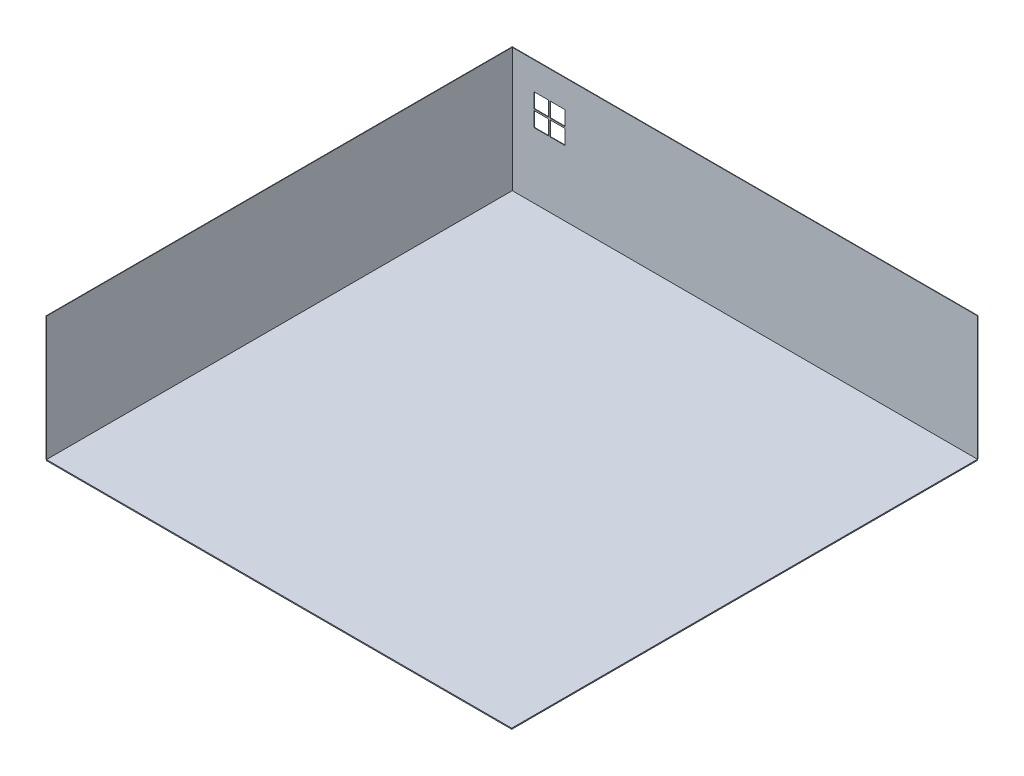
ISO-10303-21;
HEADER;
FILE_DESCRIPTION(('STEP AP214'),'2;1');
FILE_NAME('part.step','',(''),(''),'','','');
FILE_SCHEMA(('AUTOMOTIVE_DESIGN { 1 0 10303 214 1 1 1 1 }'));
ENDSEC;
DATA;
#1=APPLICATION_CONTEXT('core data for automotive mechanical design processes');
#2=APPLICATION_PROTOCOL_DEFINITION('international standard','automotive_design',2000,#1);
#3=PRODUCT_CONTEXT('',#1,'mechanical');
#4=PRODUCT('Part','Part','',(#3));
#5=PRODUCT_RELATED_PRODUCT_CATEGORY('part','',(#4));
#6=PRODUCT_DEFINITION_FORMATION('','',#4);
#7=PRODUCT_DEFINITION_CONTEXT('part definition',#1,'design');
#8=PRODUCT_DEFINITION('design','',#6,#7);
#9=PRODUCT_DEFINITION_SHAPE('','',#8);
#10=(LENGTH_UNIT() NAMED_UNIT(*) SI_UNIT(.MILLI.,.METRE.));
#11=(NAMED_UNIT(*) PLANE_ANGLE_UNIT() SI_UNIT($,.RADIAN.));
#12=(NAMED_UNIT(*) SI_UNIT($,.STERADIAN.) SOLID_ANGLE_UNIT());
#13=UNCERTAINTY_MEASURE_WITH_UNIT(LENGTH_MEASURE(1.E-05),#10,'distance_accuracy_value','');
#14=(GEOMETRIC_REPRESENTATION_CONTEXT(3) GLOBAL_UNCERTAINTY_ASSIGNED_CONTEXT((#13)) GLOBAL_UNIT_ASSIGNED_CONTEXT((#10,
#11,#12)) REPRESENTATION_CONTEXT('',''));
#15=CARTESIAN_POINT('',(0.,0.,0.));
#16=DIRECTION('',(0.,0.,1.));
#17=DIRECTION('',(1.,0.,0.));
#18=AXIS2_PLACEMENT_3D('',#15,#16,#17);
#19=CARTESIAN_POINT('',(9134.,-20.,0.));
#20=DIRECTION('',(1.,0.,0.));
#21=DIRECTION('',(0.,0.,-1.));
#22=AXIS2_PLACEMENT_3D('',#19,#20,#21);
#23=PLANE('',#22);
#24=DIRECTION('',(0.,0.,-1.));
#25=VECTOR('',#24,1.);
#26=CARTESIAN_POINT('',(9134.,0.,0.));
#27=LINE('',#26,#25);
#28=CARTESIAN_POINT('',(9134.,0.,3.72047697580966E-13));
#29=VERTEX_POINT('',#28);
#30=CARTESIAN_POINT('',(9134.,0.,-9144.));
#31=VERTEX_POINT('',#30);
#32=EDGE_CURVE('E121',#29,#31,#27,.T.);
#33=ORIENTED_EDGE('',*,*,#32,.F.);
#34=DIRECTION('',(0.,1.,0.));
#35=VECTOR('',#34,1.);
#36=CARTESIAN_POINT('',(9134.,-20.,3.72047697580966E-13));
#37=LINE('',#36,#35);
#38=CARTESIAN_POINT('',(9134.,-20.,3.72047697580966E-13));
#39=VERTEX_POINT('',#38);
#40=EDGE_CURVE('E12',#39,#29,#37,.T.);
#41=ORIENTED_EDGE('',*,*,#40,.F.);
#42=DIRECTION('',(0.,0.,-1.));
#43=VECTOR('',#42,1.);
#44=CARTESIAN_POINT('',(9134.,-20.,0.));
#45=LINE('',#44,#43);
#46=CARTESIAN_POINT('',(9134.,-20.,-9144.));
#47=VERTEX_POINT('',#46);
#48=EDGE_CURVE('E110',#39,#47,#45,.T.);
#49=ORIENTED_EDGE('',*,*,#48,.T.);
#50=DIRECTION('',(0.,1.,0.));
#51=VECTOR('',#50,1.);
#52=CARTESIAN_POINT('',(9134.,-20.,-9144.));
#53=LINE('',#52,#51);
#54=EDGE_CURVE('E70',#47,#31,#53,.T.);
#55=ORIENTED_EDGE('',*,*,#54,.T.);
#56=EDGE_LOOP('',(#33,#41,#49,#55));
#57=FACE_BOUND('',#56,.T.);
#58=ADVANCED_FACE('F53',(#57),#23,.T.);
#59=CARTESIAN_POINT('',(0.,-20.,0.));
#60=DIRECTION('',(0.,0.,1.));
#61=DIRECTION('',(1.,0.,0.));
#62=AXIS2_PLACEMENT_3D('',#59,#60,#61);
#63=PLANE('',#62);
#64=DIRECTION('',(1.,0.,0.));
#65=VECTOR('',#64,1.);
#66=CARTESIAN_POINT('',(0.,0.,0.));
#67=LINE('',#66,#65);
#68=CARTESIAN_POINT('',(0.,0.,0.));
#69=VERTEX_POINT('',#68);
#70=EDGE_CURVE('E100',#69,#29,#67,.T.);
#71=ORIENTED_EDGE('',*,*,#70,.F.);
#72=DIRECTION('',(0.,1.,0.));
#73=VECTOR('',#72,1.);
#74=CARTESIAN_POINT('',(0.,-20.,0.));
#75=LINE('',#74,#73);
#76=CARTESIAN_POINT('',(0.,-20.,0.));
#77=VERTEX_POINT('',#76);
#78=EDGE_CURVE('E62',#77,#69,#75,.T.);
#79=ORIENTED_EDGE('',*,*,#78,.F.);
#80=DIRECTION('',(1.,0.,0.));
#81=VECTOR('',#80,1.);
#82=CARTESIAN_POINT('',(0.,-20.,0.));
#83=LINE('',#82,#81);
#84=EDGE_CURVE('E98',#77,#39,#83,.T.);
#85=ORIENTED_EDGE('',*,*,#84,.T.);
#86=ORIENTED_EDGE('',*,*,#40,.T.);
#87=EDGE_LOOP('',(#71,#79,#85,#86));
#88=FACE_BOUND('',#87,.T.);
#89=ADVANCED_FACE('F97',(#88),#63,.T.);
#90=CARTESIAN_POINT('',(0.,-20.,0.));
#91=DIRECTION('',(-1.,0.,0.));
#92=DIRECTION('',(0.,0.,1.));
#93=AXIS2_PLACEMENT_3D('',#90,#91,#92);
#94=PLANE('',#93);
#95=DIRECTION('',(0.,0.,1.));
#96=VECTOR('',#95,1.);
#97=CARTESIAN_POINT('',(0.,0.,0.));
#98=LINE('',#97,#96);
#99=CARTESIAN_POINT('',(0.,0.,-9144.));
#100=VERTEX_POINT('',#99);
#101=EDGE_CURVE('E126',#100,#69,#98,.T.);
#102=ORIENTED_EDGE('',*,*,#101,.F.);
#103=DIRECTION('',(0.,1.,0.));
#104=VECTOR('',#103,1.);
#105=CARTESIAN_POINT('',(0.,-20.,-9144.));
#106=LINE('',#105,#104);
#107=CARTESIAN_POINT('',(0.,-20.,-9144.));
#108=VERTEX_POINT('',#107);
#109=EDGE_CURVE('E83',#108,#100,#106,.T.);
#110=ORIENTED_EDGE('',*,*,#109,.F.);
#111=DIRECTION('',(0.,0.,1.));
#112=VECTOR('',#111,1.);
#113=CARTESIAN_POINT('',(0.,-20.,0.));
#114=LINE('',#113,#112);
#115=EDGE_CURVE('E109',#108,#77,#114,.T.);
#116=ORIENTED_EDGE('',*,*,#115,.T.);
#117=ORIENTED_EDGE('',*,*,#78,.T.);
#118=EDGE_LOOP('',(#102,#110,#116,#117));
#119=FACE_BOUND('',#118,.T.);
#120=ADVANCED_FACE('F113',(#119),#94,.T.);
#121=CARTESIAN_POINT('',(0.,-20.,-9144.));
#122=DIRECTION('',(0.,0.,-1.));
#123=DIRECTION('',(-1.,0.,0.));
#124=AXIS2_PLACEMENT_3D('',#121,#122,#123);
#125=PLANE('',#124);
#126=DIRECTION('',(-1.,0.,0.));
#127=VECTOR('',#126,1.);
#128=CARTESIAN_POINT('',(0.,0.,-9144.));
#129=LINE('',#128,#127);
#130=EDGE_CURVE('E129',#31,#100,#129,.T.);
#131=ORIENTED_EDGE('',*,*,#130,.F.);
#132=ORIENTED_EDGE('',*,*,#54,.F.);
#133=DIRECTION('',(-1.,0.,0.));
#134=VECTOR('',#133,1.);
#135=CARTESIAN_POINT('',(0.,-20.,-9144.));
#136=LINE('',#135,#134);
#137=EDGE_CURVE('E115',#47,#108,#136,.T.);
#138=ORIENTED_EDGE('',*,*,#137,.T.);
#139=ORIENTED_EDGE('',*,*,#109,.T.);
#140=EDGE_LOOP('',(#131,#132,#138,#139));
#141=FACE_BOUND('',#140,.T.);
#142=ADVANCED_FACE('F138',(#141),#125,.T.);
#143=CARTESIAN_POINT('',(0.,-20.,0.));
#144=DIRECTION('',(0.,-1.,0.));
#145=DIRECTION('',(0.,0.,-1.));
#146=AXIS2_PLACEMENT_3D('',#143,#144,#145);
#147=PLANE('',#146);
#148=ORIENTED_EDGE('',*,*,#48,.F.);
#149=ORIENTED_EDGE('',*,*,#84,.F.);
#150=ORIENTED_EDGE('',*,*,#115,.F.);
#151=ORIENTED_EDGE('',*,*,#137,.F.);
#152=EDGE_LOOP('',(#148,#149,#150,#151));
#153=FACE_BOUND('',#152,.T.);
#154=ADVANCED_FACE('F107',(#153),#147,.T.);
#155=CARTESIAN_POINT('',(0.,0.,0.));
#156=DIRECTION('',(0.,-1.,0.));
#157=DIRECTION('',(0.,0.,-1.));
#158=AXIS2_PLACEMENT_3D('',#155,#156,#157);
#159=PLANE('',#158);
#160=ORIENTED_EDGE('',*,*,#32,.T.);
#161=ORIENTED_EDGE('',*,*,#130,.T.);
#162=ORIENTED_EDGE('',*,*,#101,.T.);
#163=ORIENTED_EDGE('',*,*,#70,.T.);
#164=EDGE_LOOP('',(#160,#161,#162,#163));
#165=FACE_BOUND('',#164,.T.);
#166=ADVANCED_FACE('F145',(#165),#159,.F.);
#167=CLOSED_SHELL('',(#58,#89,#120,#142,#154,#166));
#168=MANIFOLD_SOLID_BREP('B2',#167);
#169=CARTESIAN_POINT('',(-10.,2438.4,-9154.));
#170=DIRECTION('',(0.,0.,-1.));
#171=DIRECTION('',(-1.,0.,0.));
#172=AXIS2_PLACEMENT_3D('',#169,#170,#171);
#173=PLANE('',#172);
#174=DIRECTION('',(1.,0.,0.));
#175=VECTOR('',#174,1.);
#176=CARTESIAN_POINT('',(0.,1605.40968708855,-9154.));
#177=LINE('',#176,#175);
#178=CARTESIAN_POINT('',(422.962791313637,1605.40968708855,-9154.));
#179=VERTEX_POINT('',#178);
#180=CARTESIAN_POINT('',(712.762791313637,1605.40968708855,-9154.));
#181=VERTEX_POINT('',#180);
#182=EDGE_CURVE('E446',#179,#181,#177,.T.);
#183=ORIENTED_EDGE('',*,*,#182,.T.);
#184=DIRECTION('',(0.,1.,0.));
#185=VECTOR('',#184,1.);
#186=CARTESIAN_POINT('',(712.762791313637,0.,-9154.));
#187=LINE('',#186,#185);
#188=CARTESIAN_POINT('',(712.762791313637,1895.20968708855,-9154.));
#189=VERTEX_POINT('',#188);
#190=EDGE_CURVE('E449',#181,#189,#187,.T.);
#191=ORIENTED_EDGE('',*,*,#190,.T.);
#192=DIRECTION('',(1.,0.,0.));
#193=VECTOR('',#192,1.);
#194=CARTESIAN_POINT('',(6.90323304166125E-13,1895.20968708855,-9154.));
#195=LINE('',#194,#193);
#196=CARTESIAN_POINT('',(422.962791313637,1895.20968708855,-9154.));
#197=VERTEX_POINT('',#196);
#198=EDGE_CURVE('E453',#197,#189,#195,.T.);
#199=ORIENTED_EDGE('',*,*,#198,.F.);
#200=DIRECTION('',(0.,1.,0.));
#201=VECTOR('',#200,1.);
#202=CARTESIAN_POINT('',(422.962791313637,0.,-9154.));
#203=LINE('',#202,#201);
#204=EDGE_CURVE('E456',#179,#197,#203,.T.);
#205=ORIENTED_EDGE('',*,*,#204,.F.);
#206=EDGE_LOOP('',(#183,#191,#199,#205));
#207=FACE_BOUND('',#206,.T.);
#208=DIRECTION('',(1.,0.,0.));
#209=VECTOR('',#208,1.);
#210=CARTESIAN_POINT('',(-10.,0.,-9154.));
#211=LINE('',#210,#209);
#212=CARTESIAN_POINT('',(-10.,0.,-9154.));
#213=VERTEX_POINT('',#212);
#214=CARTESIAN_POINT('',(9134.,0.,-9154.));
#215=VERTEX_POINT('',#214);
#216=EDGE_CURVE('E499',#213,#215,#211,.T.);
#217=ORIENTED_EDGE('',*,*,#216,.F.);
#218=DIRECTION('',(0.,-1.,0.));
#219=VECTOR('',#218,1.);
#220=CARTESIAN_POINT('',(-10.,2438.4,-9154.));
#221=LINE('',#220,#219);
#222=CARTESIAN_POINT('',(-10.,2438.4,-9154.));
#223=VERTEX_POINT('',#222);
#224=EDGE_CURVE('E504',#223,#213,#221,.T.);
#225=ORIENTED_EDGE('',*,*,#224,.F.);
#226=DIRECTION('',(1.,0.,0.));
#227=VECTOR('',#226,1.);
#228=CARTESIAN_POINT('',(-10.,2438.4,-9154.));
#229=LINE('',#228,#227);
#230=CARTESIAN_POINT('',(9134.,2438.4,-9154.));
#231=VERTEX_POINT('',#230);
#232=EDGE_CURVE('E501',#223,#231,#229,.T.);
#233=ORIENTED_EDGE('',*,*,#232,.T.);
#234=DIRECTION('',(0.,-1.,0.));
#235=VECTOR('',#234,1.);
#236=CARTESIAN_POINT('',(9134.,2438.4,-9154.));
#237=LINE('',#236,#235);
#238=EDGE_CURVE('E512',#231,#215,#237,.T.);
#239=ORIENTED_EDGE('',*,*,#238,.T.);
#240=EDGE_LOOP('',(#217,#225,#233,#239));
#241=FACE_BOUND('',#240,.T.);
#242=DIRECTION('',(1.,0.,0.));
#243=VECTOR('',#242,1.);
#244=CARTESIAN_POINT('',(6.90323304166125E-13,1895.20968708855,-9154.));
#245=LINE('',#244,#243);
#246=CARTESIAN_POINT('',(742.762791313637,1895.20968708855,-9154.));
#247=VERTEX_POINT('',#246);
#248=CARTESIAN_POINT('',(1032.56279131364,1895.20968708855,-9154.));
#249=VERTEX_POINT('',#248);
#250=EDGE_CURVE('E356',#247,#249,#245,.T.);
#251=ORIENTED_EDGE('',*,*,#250,.F.);
#252=DIRECTION('',(0.,1.,0.));
#253=VECTOR('',#252,1.);
#254=CARTESIAN_POINT('',(742.762791313637,0.,-9154.));
#255=LINE('',#254,#253);
#256=CARTESIAN_POINT('',(742.762791313637,1605.40968708855,-9154.));
#257=VERTEX_POINT('',#256);
#258=EDGE_CURVE('E348',#257,#247,#255,.T.);
#259=ORIENTED_EDGE('',*,*,#258,.F.);
#260=DIRECTION('',(1.,0.,0.));
#261=VECTOR('',#260,1.);
#262=CARTESIAN_POINT('',(0.,1605.40968708855,-9154.));
#263=LINE('',#262,#261);
#264=CARTESIAN_POINT('',(1032.56279131364,1605.40968708855,-9154.));
#265=VERTEX_POINT('',#264);
#266=EDGE_CURVE('E360',#257,#265,#263,.T.);
#267=ORIENTED_EDGE('',*,*,#266,.T.);
#268=DIRECTION('',(0.,1.,0.));
#269=VECTOR('',#268,1.);
#270=CARTESIAN_POINT('',(1032.56279131364,0.,-9154.));
#271=LINE('',#270,#269);
#272=EDGE_CURVE('E364',#265,#249,#271,.T.);
#273=ORIENTED_EDGE('',*,*,#272,.T.);
#274=EDGE_LOOP('',(#251,#259,#267,#273));
#275=FACE_BOUND('',#274,.T.);
#276=DIRECTION('',(0.,1.,0.));
#277=VECTOR('',#276,1.);
#278=CARTESIAN_POINT('',(1032.56279131364,0.,-9154.));
#279=LINE('',#278,#277);
#280=CARTESIAN_POINT('',(1032.56279131364,1285.60968708855,-9154.));
#281=VERTEX_POINT('',#280);
#282=CARTESIAN_POINT('',(1032.56279131364,1575.40968708855,-9154.));
#283=VERTEX_POINT('',#282);
#284=EDGE_CURVE('E395',#281,#283,#279,.T.);
#285=ORIENTED_EDGE('',*,*,#284,.T.);
#286=DIRECTION('',(1.,0.,0.));
#287=VECTOR('',#286,1.);
#288=CARTESIAN_POINT('',(0.,1575.40968708855,-9154.));
#289=LINE('',#288,#287);
#290=CARTESIAN_POINT('',(742.762791313637,1575.40968708855,-9154.));
#291=VERTEX_POINT('',#290);
#292=EDGE_CURVE('E388',#291,#283,#289,.T.);
#293=ORIENTED_EDGE('',*,*,#292,.F.);
#294=DIRECTION('',(0.,-1.,0.));
#295=VECTOR('',#294,1.);
#296=CARTESIAN_POINT('',(742.762791313637,0.,-9154.));
#297=LINE('',#296,#295);
#298=CARTESIAN_POINT('',(742.762791313637,1285.60968708855,-9154.));
#299=VERTEX_POINT('',#298);
#300=EDGE_CURVE('E390',#291,#299,#297,.T.);
#301=ORIENTED_EDGE('',*,*,#300,.T.);
#302=DIRECTION('',(1.,0.,0.));
#303=VECTOR('',#302,1.);
#304=CARTESIAN_POINT('',(4.68278699241094E-13,1285.60968708855,-9154.));
#305=LINE('',#304,#303);
#306=EDGE_CURVE('E219',#299,#281,#305,.T.);
#307=ORIENTED_EDGE('',*,*,#306,.T.);
#308=EDGE_LOOP('',(#285,#293,#301,#307));
#309=FACE_BOUND('',#308,.T.);
#310=DIRECTION('',(1.,0.,0.));
#311=VECTOR('',#310,1.);
#312=CARTESIAN_POINT('',(4.68278699241094E-13,1285.60968708855,-9154.));
#313=LINE('',#312,#311);
#314=CARTESIAN_POINT('',(422.962791313637,1285.60968708855,-9154.));
#315=VERTEX_POINT('',#314);
#316=CARTESIAN_POINT('',(712.762791313637,1285.60968708855,-9154.));
#317=VERTEX_POINT('',#316);
#318=EDGE_CURVE('E425',#315,#317,#313,.T.);
#319=ORIENTED_EDGE('',*,*,#318,.T.);
#320=DIRECTION('',(0.,-1.,0.));
#321=VECTOR('',#320,1.);
#322=CARTESIAN_POINT('',(712.762791313637,0.,-9154.));
#323=LINE('',#322,#321);
#324=CARTESIAN_POINT('',(712.762791313637,1575.40968708855,-9154.));
#325=VERTEX_POINT('',#324);
#326=EDGE_CURVE('E418',#325,#317,#323,.T.);
#327=ORIENTED_EDGE('',*,*,#326,.F.);
#328=DIRECTION('',(1.,0.,0.));
#329=VECTOR('',#328,1.);
#330=CARTESIAN_POINT('',(0.,1575.40968708855,-9154.));
#331=LINE('',#330,#329);
#332=CARTESIAN_POINT('',(422.962791313637,1575.40968708855,-9154.));
#333=VERTEX_POINT('',#332);
#334=EDGE_CURVE('E420',#333,#325,#331,.T.);
#335=ORIENTED_EDGE('',*,*,#334,.F.);
#336=DIRECTION('',(0.,1.,0.));
#337=VECTOR('',#336,1.);
#338=CARTESIAN_POINT('',(422.962791313637,0.,-9154.));
#339=LINE('',#338,#337);
#340=EDGE_CURVE('E423',#315,#333,#339,.T.);
#341=ORIENTED_EDGE('',*,*,#340,.F.);
#342=EDGE_LOOP('',(#319,#327,#335,#341));
#343=FACE_BOUND('',#342,.T.);
#344=ADVANCED_FACE('F194',(#207,#241,#275,#309,#343),#173,.T.);
#345=CARTESIAN_POINT('',(-10.,2438.4,-9144.));
#346=DIRECTION('',(0.,0.,-1.));
#347=DIRECTION('',(-1.,0.,0.));
#348=AXIS2_PLACEMENT_3D('',#345,#346,#347);
#349=PLANE('',#348);
#350=DIRECTION('',(1.,0.,0.));
#351=VECTOR('',#350,1.);
#352=CARTESIAN_POINT('',(0.,1575.40968708855,-9144.));
#353=LINE('',#352,#351);
#354=CARTESIAN_POINT('',(742.762791313637,1575.40968708855,-9144.));
#355=VERTEX_POINT('',#354);
#356=CARTESIAN_POINT('',(1032.56279131364,1575.40968708855,-9144.));
#357=VERTEX_POINT('',#356);
#358=EDGE_CURVE('E399',#355,#357,#353,.T.);
#359=ORIENTED_EDGE('',*,*,#358,.T.);
#360=DIRECTION('',(0.,1.,0.));
#361=VECTOR('',#360,1.);
#362=CARTESIAN_POINT('',(1032.56279131364,0.,-9144.));
#363=LINE('',#362,#361);
#364=CARTESIAN_POINT('',(1032.56279131364,1285.60968708855,-9144.));
#365=VERTEX_POINT('',#364);
#366=EDGE_CURVE('E391',#365,#357,#363,.T.);
#367=ORIENTED_EDGE('',*,*,#366,.F.);
#368=DIRECTION('',(1.,0.,0.));
#369=VECTOR('',#368,1.);
#370=CARTESIAN_POINT('',(4.68278699241094E-13,1285.60968708855,-9144.));
#371=LINE('',#370,#369);
#372=CARTESIAN_POINT('',(742.762791313637,1285.60968708855,-9144.));
#373=VERTEX_POINT('',#372);
#374=EDGE_CURVE('E406',#373,#365,#371,.T.);
#375=ORIENTED_EDGE('',*,*,#374,.F.);
#376=DIRECTION('',(0.,-1.,0.));
#377=VECTOR('',#376,1.);
#378=CARTESIAN_POINT('',(742.762791313637,0.,-9144.));
#379=LINE('',#378,#377);
#380=EDGE_CURVE('E402',#355,#373,#379,.T.);
#381=ORIENTED_EDGE('',*,*,#380,.F.);
#382=EDGE_LOOP('',(#359,#367,#375,#381));
#383=FACE_BOUND('',#382,.T.);
#384=DIRECTION('',(1.,0.,0.));
#385=VECTOR('',#384,1.);
#386=CARTESIAN_POINT('',(-10.,2438.4,-9144.));
#387=LINE('',#386,#385);
#388=CARTESIAN_POINT('',(0.,2438.4,-9144.));
#389=VERTEX_POINT('',#388);
#390=CARTESIAN_POINT('',(9134.,2438.4,-9144.));
#391=VERTEX_POINT('',#390);
#392=EDGE_CURVE('E496',#389,#391,#387,.T.);
#393=ORIENTED_EDGE('',*,*,#392,.F.);
#394=DIRECTION('',(0.,-1.,0.));
#395=VECTOR('',#394,1.);
#396=CARTESIAN_POINT('',(0.,2438.4,-9144.));
#397=LINE('',#396,#395);
#398=CARTESIAN_POINT('',(0.,0.,-9144.));
#399=VERTEX_POINT('',#398);
#400=EDGE_CURVE('E486',#389,#399,#397,.T.);
#401=ORIENTED_EDGE('',*,*,#400,.T.);
#402=DIRECTION('',(1.,0.,0.));
#403=VECTOR('',#402,1.);
#404=CARTESIAN_POINT('',(-10.,0.,-9144.));
#405=LINE('',#404,#403);
#406=CARTESIAN_POINT('',(9134.,0.,-9144.));
#407=VERTEX_POINT('',#406);
#408=EDGE_CURVE('E470',#399,#407,#405,.T.);
#409=ORIENTED_EDGE('',*,*,#408,.T.);
#410=DIRECTION('',(0.,-1.,0.));
#411=VECTOR('',#410,1.);
#412=CARTESIAN_POINT('',(9134.,2438.4,-9144.));
#413=LINE('',#412,#411);
#414=EDGE_CURVE('E198',#391,#407,#413,.T.);
#415=ORIENTED_EDGE('',*,*,#414,.F.);
#416=EDGE_LOOP('',(#393,#401,#409,#415));
#417=FACE_BOUND('',#416,.T.);
#418=DIRECTION('',(0.,1.,0.));
#419=VECTOR('',#418,1.);
#420=CARTESIAN_POINT('',(712.762791313637,0.,-9144.));
#421=LINE('',#420,#419);
#422=CARTESIAN_POINT('',(712.762791313637,1605.40968708855,-9144.));
#423=VERTEX_POINT('',#422);
#424=CARTESIAN_POINT('',(712.762791313637,1895.20968708855,-9144.));
#425=VERTEX_POINT('',#424);
#426=EDGE_CURVE('E460',#423,#425,#421,.T.);
#427=ORIENTED_EDGE('',*,*,#426,.F.);
#428=DIRECTION('',(1.,0.,0.));
#429=VECTOR('',#428,1.);
#430=CARTESIAN_POINT('',(0.,1605.40968708855,-9144.));
#431=LINE('',#430,#429);
#432=CARTESIAN_POINT('',(422.962791313637,1605.40968708855,-9144.));
#433=VERTEX_POINT('',#432);
#434=EDGE_CURVE('E384',#433,#423,#431,.T.);
#435=ORIENTED_EDGE('',*,*,#434,.F.);
#436=DIRECTION('',(0.,1.,0.));
#437=VECTOR('',#436,1.);
#438=CARTESIAN_POINT('',(422.962791313637,0.,-9144.));
#439=LINE('',#438,#437);
#440=CARTESIAN_POINT('',(422.962791313637,1895.20968708855,-9144.));
#441=VERTEX_POINT('',#440);
#442=EDGE_CURVE('E450',#433,#441,#439,.T.);
#443=ORIENTED_EDGE('',*,*,#442,.T.);
#444=DIRECTION('',(1.,0.,0.));
#445=VECTOR('',#444,1.);
#446=CARTESIAN_POINT('',(6.90323304166125E-13,1895.20968708855,-9144.));
#447=LINE('',#446,#445);
#448=EDGE_CURVE('E463',#441,#425,#447,.T.);
#449=ORIENTED_EDGE('',*,*,#448,.T.);
#450=EDGE_LOOP('',(#427,#435,#443,#449));
#451=FACE_BOUND('',#450,.T.);
#452=DIRECTION('',(0.,1.,0.));
#453=VECTOR('',#452,1.);
#454=CARTESIAN_POINT('',(742.762791313637,0.,-9144.));
#455=LINE('',#454,#453);
#456=CARTESIAN_POINT('',(742.762791313637,1605.40968708855,-9144.));
#457=VERTEX_POINT('',#456);
#458=CARTESIAN_POINT('',(742.762791313637,1895.20968708855,-9144.));
#459=VERTEX_POINT('',#458);
#460=EDGE_CURVE('E351',#457,#459,#455,.T.);
#461=ORIENTED_EDGE('',*,*,#460,.T.);
#462=DIRECTION('',(1.,0.,0.));
#463=VECTOR('',#462,1.);
#464=CARTESIAN_POINT('',(6.90323304166125E-13,1895.20968708855,-9144.));
#465=LINE('',#464,#463);
#466=CARTESIAN_POINT('',(1032.56279131364,1895.20968708855,-9144.));
#467=VERTEX_POINT('',#466);
#468=EDGE_CURVE('E368',#459,#467,#465,.T.);
#469=ORIENTED_EDGE('',*,*,#468,.T.);
#470=DIRECTION('',(0.,1.,0.));
#471=VECTOR('',#470,1.);
#472=CARTESIAN_POINT('',(1032.56279131364,0.,-9144.));
#473=LINE('',#472,#471);
#474=CARTESIAN_POINT('',(1032.56279131364,1605.40968708855,-9144.));
#475=VERTEX_POINT('',#474);
#476=EDGE_CURVE('E371',#475,#467,#473,.T.);
#477=ORIENTED_EDGE('',*,*,#476,.F.);
#478=DIRECTION('',(1.,0.,0.));
#479=VECTOR('',#478,1.);
#480=CARTESIAN_POINT('',(0.,1605.40968708855,-9144.));
#481=LINE('',#480,#479);
#482=EDGE_CURVE('E377',#457,#475,#481,.T.);
#483=ORIENTED_EDGE('',*,*,#482,.F.);
#484=EDGE_LOOP('',(#461,#469,#477,#483));
#485=FACE_BOUND('',#484,.T.);
#486=DIRECTION('',(0.,-1.,0.));
#487=VECTOR('',#486,1.);
#488=CARTESIAN_POINT('',(712.762791313637,0.,-9144.));
#489=LINE('',#488,#487);
#490=CARTESIAN_POINT('',(712.762791313637,1575.40968708855,-9144.));
#491=VERTEX_POINT('',#490);
#492=CARTESIAN_POINT('',(712.762791313637,1285.60968708855,-9144.));
#493=VERTEX_POINT('',#492);
#494=EDGE_CURVE('E429',#491,#493,#489,.T.);
#495=ORIENTED_EDGE('',*,*,#494,.T.);
#496=DIRECTION('',(1.,0.,0.));
#497=VECTOR('',#496,1.);
#498=CARTESIAN_POINT('',(4.68278699241094E-13,1285.60968708855,-9144.));
#499=LINE('',#498,#497);
#500=CARTESIAN_POINT('',(422.962791313637,1285.60968708855,-9144.));
#501=VERTEX_POINT('',#500);
#502=EDGE_CURVE('E421',#501,#493,#499,.T.);
#503=ORIENTED_EDGE('',*,*,#502,.F.);
#504=DIRECTION('',(0.,1.,0.));
#505=VECTOR('',#504,1.);
#506=CARTESIAN_POINT('',(422.962791313637,0.,-9144.));
#507=LINE('',#506,#505);
#508=CARTESIAN_POINT('',(422.962791313637,1575.40968708855,-9144.));
#509=VERTEX_POINT('',#508);
#510=EDGE_CURVE('E435',#501,#509,#507,.T.);
#511=ORIENTED_EDGE('',*,*,#510,.T.);
#512=DIRECTION('',(1.,0.,0.));
#513=VECTOR('',#512,1.);
#514=CARTESIAN_POINT('',(0.,1575.40968708855,-9144.));
#515=LINE('',#514,#513);
#516=EDGE_CURVE('E432',#509,#491,#515,.T.);
#517=ORIENTED_EDGE('',*,*,#516,.T.);
#518=EDGE_LOOP('',(#495,#503,#511,#517));
#519=FACE_BOUND('',#518,.T.);
#520=ADVANCED_FACE('F196',(#383,#417,#451,#485,#519),#349,.F.);
#521=CARTESIAN_POINT('',(-10.,2438.4,0.));
#522=DIRECTION('',(-1.,0.,0.));
#523=DIRECTION('',(0.,0.,1.));
#524=AXIS2_PLACEMENT_3D('',#521,#522,#523);
#525=PLANE('',#524);
#526=DIRECTION('',(0.,0.,-1.));
#527=VECTOR('',#526,1.);
#528=CARTESIAN_POINT('',(-10.,0.,0.));
#529=LINE('',#528,#527);
#530=CARTESIAN_POINT('',(-10.,0.,0.));
#531=VERTEX_POINT('',#530);
#532=EDGE_CURVE('E487',#531,#213,#529,.T.);
#533=ORIENTED_EDGE('',*,*,#532,.F.);
#534=DIRECTION('',(0.,-1.,0.));
#535=VECTOR('',#534,1.);
#536=CARTESIAN_POINT('',(-10.,2438.4,0.));
#537=LINE('',#536,#535);
#538=CARTESIAN_POINT('',(-10.,2438.4,0.));
#539=VERTEX_POINT('',#538);
#540=EDGE_CURVE('E51',#539,#531,#537,.T.);
#541=ORIENTED_EDGE('',*,*,#540,.F.);
#542=DIRECTION('',(0.,0.,-1.));
#543=VECTOR('',#542,1.);
#544=CARTESIAN_POINT('',(-10.,2438.4,0.));
#545=LINE('',#544,#543);
#546=EDGE_CURVE('E477',#539,#223,#545,.T.);
#547=ORIENTED_EDGE('',*,*,#546,.T.);
#548=ORIENTED_EDGE('',*,*,#224,.T.);
#549=EDGE_LOOP('',(#533,#541,#547,#548));
#550=FACE_BOUND('',#549,.T.);
#551=ADVANCED_FACE('F543',(#550),#525,.T.);
#552=CARTESIAN_POINT('',(0.,2438.4,0.));
#553=DIRECTION('',(0.,0.,1.));
#554=DIRECTION('',(1.,0.,0.));
#555=AXIS2_PLACEMENT_3D('',#552,#553,#554);
#556=PLANE('',#555);
#557=DIRECTION('',(-1.,0.,0.));
#558=VECTOR('',#557,1.);
#559=CARTESIAN_POINT('',(0.,0.,0.));
#560=LINE('',#559,#558);
#561=CARTESIAN_POINT('',(0.,0.,0.));
#562=VERTEX_POINT('',#561);
#563=EDGE_CURVE('E489',#562,#531,#560,.T.);
#564=ORIENTED_EDGE('',*,*,#563,.F.);
#565=DIRECTION('',(0.,-1.,0.));
#566=VECTOR('',#565,1.);
#567=CARTESIAN_POINT('',(0.,2438.4,0.));
#568=LINE('',#567,#566);
#569=CARTESIAN_POINT('',(0.,2438.4,0.));
#570=VERTEX_POINT('',#569);
#571=EDGE_CURVE('E203',#570,#562,#568,.T.);
#572=ORIENTED_EDGE('',*,*,#571,.F.);
#573=DIRECTION('',(-1.,0.,0.));
#574=VECTOR('',#573,1.);
#575=CARTESIAN_POINT('',(0.,2438.4,0.));
#576=LINE('',#575,#574);
#577=EDGE_CURVE('E479',#570,#539,#576,.T.);
#578=ORIENTED_EDGE('',*,*,#577,.T.);
#579=ORIENTED_EDGE('',*,*,#540,.T.);
#580=EDGE_LOOP('',(#564,#572,#578,#579));
#581=FACE_BOUND('',#580,.T.);
#582=ADVANCED_FACE('F542',(#581),#556,.T.);
#583=CARTESIAN_POINT('',(0.,2438.4,0.));
#584=DIRECTION('',(-1.,0.,0.));
#585=DIRECTION('',(0.,0.,1.));
#586=AXIS2_PLACEMENT_3D('',#583,#584,#585);
#587=PLANE('',#586);
#588=DIRECTION('',(0.,0.,-1.));
#589=VECTOR('',#588,1.);
#590=CARTESIAN_POINT('',(0.,0.,0.));
#591=LINE('',#590,#589);
#592=EDGE_CURVE('E480',#562,#399,#591,.T.);
#593=ORIENTED_EDGE('',*,*,#592,.T.);
#594=ORIENTED_EDGE('',*,*,#400,.F.);
#595=DIRECTION('',(0.,0.,-1.));
#596=VECTOR('',#595,1.);
#597=CARTESIAN_POINT('',(0.,2438.4,0.));
#598=LINE('',#597,#596);
#599=EDGE_CURVE('E483',#570,#389,#598,.T.);
#600=ORIENTED_EDGE('',*,*,#599,.F.);
#601=ORIENTED_EDGE('',*,*,#571,.T.);
#602=EDGE_LOOP('',(#593,#594,#600,#601));
#603=FACE_BOUND('',#602,.T.);
#604=ADVANCED_FACE('F539',(#603),#587,.F.);
#605=CARTESIAN_POINT('',(0.,2438.4,0.));
#606=DIRECTION('',(0.,1.,0.));
#607=DIRECTION('',(0.,0.,1.));
#608=AXIS2_PLACEMENT_3D('',#605,#606,#607);
#609=PLANE('',#608);
#610=ORIENTED_EDGE('',*,*,#546,.F.);
#611=ORIENTED_EDGE('',*,*,#577,.F.);
#612=ORIENTED_EDGE('',*,*,#599,.T.);
#613=ORIENTED_EDGE('',*,*,#392,.T.);
#614=DIRECTION('',(0.,0.,-1.));
#615=VECTOR('',#614,1.);
#616=CARTESIAN_POINT('',(9134.,2438.4,-9144.));
#617=LINE('',#616,#615);
#618=EDGE_CURVE('E498',#391,#231,#617,.T.);
#619=ORIENTED_EDGE('',*,*,#618,.T.);
#620=ORIENTED_EDGE('',*,*,#232,.F.);
#621=EDGE_LOOP('',(#610,#611,#612,#613,#619,#620));
#622=FACE_BOUND('',#621,.T.);
#623=ADVANCED_FACE('F535',(#622),#609,.T.);
#624=CARTESIAN_POINT('',(0.,0.,0.));
#625=DIRECTION('',(0.,1.,0.));
#626=DIRECTION('',(0.,0.,1.));
#627=AXIS2_PLACEMENT_3D('',#624,#625,#626);
#628=PLANE('',#627);
#629=ORIENTED_EDGE('',*,*,#532,.T.);
#630=ORIENTED_EDGE('',*,*,#216,.T.);
#631=DIRECTION('',(0.,0.,-1.));
#632=VECTOR('',#631,1.);
#633=CARTESIAN_POINT('',(9134.,0.,-9144.));
#634=LINE('',#633,#632);
#635=EDGE_CURVE('E506',#407,#215,#634,.T.);
#636=ORIENTED_EDGE('',*,*,#635,.F.);
#637=ORIENTED_EDGE('',*,*,#408,.F.);
#638=ORIENTED_EDGE('',*,*,#592,.F.);
#639=ORIENTED_EDGE('',*,*,#563,.T.);
#640=EDGE_LOOP('',(#629,#630,#636,#637,#638,#639));
#641=FACE_BOUND('',#640,.T.);
#642=ADVANCED_FACE('F528',(#641),#628,.F.);
#643=CARTESIAN_POINT('',(9134.,2438.4,-9144.));
#644=DIRECTION('',(-1.,0.,0.));
#645=DIRECTION('',(0.,0.,1.));
#646=AXIS2_PLACEMENT_3D('',#643,#644,#645);
#647=PLANE('',#646);
#648=ORIENTED_EDGE('',*,*,#635,.T.);
#649=ORIENTED_EDGE('',*,*,#238,.F.);
#650=ORIENTED_EDGE('',*,*,#618,.F.);
#651=ORIENTED_EDGE('',*,*,#414,.T.);
#652=EDGE_LOOP('',(#648,#649,#650,#651));
#653=FACE_BOUND('',#652,.T.);
#654=ADVANCED_FACE('F520',(#653),#647,.F.);
#655=CARTESIAN_POINT('',(0.,1605.40968708855,-9154.));
#656=DIRECTION('',(0.,-1.,0.));
#657=DIRECTION('',(0.,0.,-1.));
#658=AXIS2_PLACEMENT_3D('',#655,#656,#657);
#659=PLANE('',#658);
#660=ORIENTED_EDGE('',*,*,#434,.T.);
#661=DIRECTION('',(0.,0.,1.));
#662=VECTOR('',#661,1.);
#663=CARTESIAN_POINT('',(712.762791313637,1605.40968708855,-9154.));
#664=LINE('',#663,#662);
#665=EDGE_CURVE('E458',#181,#423,#664,.T.);
#666=ORIENTED_EDGE('',*,*,#665,.F.);
#667=ORIENTED_EDGE('',*,*,#182,.F.);
#668=DIRECTION('',(0.,0.,1.));
#669=VECTOR('',#668,1.);
#670=CARTESIAN_POINT('',(422.962791313637,1605.40968708855,-9154.));
#671=LINE('',#670,#669);
#672=EDGE_CURVE('E468',#179,#433,#671,.T.);
#673=ORIENTED_EDGE('',*,*,#672,.T.);
#674=EDGE_LOOP('',(#660,#666,#667,#673));
#675=FACE_BOUND('',#674,.T.);
#676=ADVANCED_FACE('F554',(#675),#659,.F.);
#677=CARTESIAN_POINT('',(422.962791313637,0.,-9154.));
#678=DIRECTION('',(1.,0.,0.));
#679=DIRECTION('',(0.,0.,-1.));
#680=AXIS2_PLACEMENT_3D('',#677,#678,#679);
#681=PLANE('',#680);
#682=ORIENTED_EDGE('',*,*,#442,.F.);
#683=ORIENTED_EDGE('',*,*,#672,.F.);
#684=ORIENTED_EDGE('',*,*,#204,.T.);
#685=DIRECTION('',(0.,0.,1.));
#686=VECTOR('',#685,1.);
#687=CARTESIAN_POINT('',(422.962791313637,1895.20968708855,-9154.));
#688=LINE('',#687,#686);
#689=EDGE_CURVE('E471',#197,#441,#688,.T.);
#690=ORIENTED_EDGE('',*,*,#689,.T.);
#691=EDGE_LOOP('',(#682,#683,#684,#690));
#692=FACE_BOUND('',#691,.T.);
#693=ADVANCED_FACE('F574',(#692),#681,.T.);
#694=CARTESIAN_POINT('',(6.90323304166125E-13,1895.20968708855,-9154.));
#695=DIRECTION('',(0.,-1.,0.));
#696=DIRECTION('',(1.,0.,0.));
#697=AXIS2_PLACEMENT_3D('',#694,#695,#696);
#698=PLANE('',#697);
#699=ORIENTED_EDGE('',*,*,#448,.F.);
#700=ORIENTED_EDGE('',*,*,#689,.F.);
#701=ORIENTED_EDGE('',*,*,#198,.T.);
#702=DIRECTION('',(0.,0.,1.));
#703=VECTOR('',#702,1.);
#704=CARTESIAN_POINT('',(712.762791313637,1895.20968708855,-9154.));
#705=LINE('',#704,#703);
#706=EDGE_CURVE('E473',#189,#425,#705,.T.);
#707=ORIENTED_EDGE('',*,*,#706,.T.);
#708=EDGE_LOOP('',(#699,#700,#701,#707));
#709=FACE_BOUND('',#708,.T.);
#710=ADVANCED_FACE('F572',(#709),#698,.T.);
#711=CARTESIAN_POINT('',(712.762791313637,0.,-9154.));
#712=DIRECTION('',(1.,0.,0.));
#713=DIRECTION('',(0.,0.,-1.));
#714=AXIS2_PLACEMENT_3D('',#711,#712,#713);
#715=PLANE('',#714);
#716=ORIENTED_EDGE('',*,*,#426,.T.);
#717=ORIENTED_EDGE('',*,*,#706,.F.);
#718=ORIENTED_EDGE('',*,*,#190,.F.);
#719=ORIENTED_EDGE('',*,*,#665,.T.);
#720=EDGE_LOOP('',(#716,#717,#718,#719));
#721=FACE_BOUND('',#720,.T.);
#722=ADVANCED_FACE('F568',(#721),#715,.F.);
#723=CARTESIAN_POINT('',(742.762791313637,0.,-9154.));
#724=DIRECTION('',(1.,0.,0.));
#725=DIRECTION('',(0.,0.,-1.));
#726=AXIS2_PLACEMENT_3D('',#723,#724,#725);
#727=PLANE('',#726);
#728=ORIENTED_EDGE('',*,*,#460,.F.);
#729=DIRECTION('',(0.,0.,1.));
#730=VECTOR('',#729,1.);
#731=CARTESIAN_POINT('',(742.762791313637,1605.40968708855,-9154.));
#732=LINE('',#731,#730);
#733=EDGE_CURVE('E343',#257,#457,#732,.T.);
#734=ORIENTED_EDGE('',*,*,#733,.F.);
#735=ORIENTED_EDGE('',*,*,#258,.T.);
#736=DIRECTION('',(0.,0.,1.));
#737=VECTOR('',#736,1.);
#738=CARTESIAN_POINT('',(742.762791313637,1895.20968708855,-9154.));
#739=LINE('',#738,#737);
#740=EDGE_CURVE('E382',#247,#459,#739,.T.);
#741=ORIENTED_EDGE('',*,*,#740,.T.);
#742=EDGE_LOOP('',(#728,#734,#735,#741));
#743=FACE_BOUND('',#742,.T.);
#744=ADVANCED_FACE('F345',(#743),#727,.T.);
#745=CARTESIAN_POINT('',(6.90323304166125E-13,1895.20968708855,-9154.));
#746=DIRECTION('',(0.,-1.,0.));
#747=DIRECTION('',(1.,0.,0.));
#748=AXIS2_PLACEMENT_3D('',#745,#746,#747);
#749=PLANE('',#748);
#750=ORIENTED_EDGE('',*,*,#468,.F.);
#751=ORIENTED_EDGE('',*,*,#740,.F.);
#752=ORIENTED_EDGE('',*,*,#250,.T.);
#753=DIRECTION('',(0.,0.,1.));
#754=VECTOR('',#753,1.);
#755=CARTESIAN_POINT('',(1032.56279131364,1895.20968708855,-9154.));
#756=LINE('',#755,#754);
#757=EDGE_CURVE('E385',#249,#467,#756,.T.);
#758=ORIENTED_EDGE('',*,*,#757,.T.);
#759=EDGE_LOOP('',(#750,#751,#752,#758));
#760=FACE_BOUND('',#759,.T.);
#761=ADVANCED_FACE('F659',(#760),#749,.T.);
#762=CARTESIAN_POINT('',(1032.56279131364,0.,-9154.));
#763=DIRECTION('',(1.,0.,0.));
#764=DIRECTION('',(0.,0.,-1.));
#765=AXIS2_PLACEMENT_3D('',#762,#763,#764);
#766=PLANE('',#765);
#767=ORIENTED_EDGE('',*,*,#476,.T.);
#768=ORIENTED_EDGE('',*,*,#757,.F.);
#769=ORIENTED_EDGE('',*,*,#272,.F.);
#770=DIRECTION('',(0.,0.,1.));
#771=VECTOR('',#770,1.);
#772=CARTESIAN_POINT('',(1032.56279131364,1605.40968708855,-9154.));
#773=LINE('',#772,#771);
#774=EDGE_CURVE('E355',#265,#475,#773,.T.);
#775=ORIENTED_EDGE('',*,*,#774,.T.);
#776=EDGE_LOOP('',(#767,#768,#769,#775));
#777=FACE_BOUND('',#776,.T.);
#778=ADVANCED_FACE('F666',(#777),#766,.F.);
#779=CARTESIAN_POINT('',(0.,1605.40968708855,-9154.));
#780=DIRECTION('',(0.,-1.,0.));
#781=DIRECTION('',(0.,0.,-1.));
#782=AXIS2_PLACEMENT_3D('',#779,#780,#781);
#783=PLANE('',#782);
#784=ORIENTED_EDGE('',*,*,#482,.T.);
#785=ORIENTED_EDGE('',*,*,#774,.F.);
#786=ORIENTED_EDGE('',*,*,#266,.F.);
#787=ORIENTED_EDGE('',*,*,#733,.T.);
#788=EDGE_LOOP('',(#784,#785,#786,#787));
#789=FACE_BOUND('',#788,.T.);
#790=ADVANCED_FACE('F361',(#789),#783,.F.);
#791=CARTESIAN_POINT('',(0.,1575.40968708855,-9154.));
#792=DIRECTION('',(0.,-1.,0.));
#793=DIRECTION('',(0.,0.,-1.));
#794=AXIS2_PLACEMENT_3D('',#791,#792,#793);
#795=PLANE('',#794);
#796=ORIENTED_EDGE('',*,*,#358,.F.);
#797=DIRECTION('',(0.,0.,1.));
#798=VECTOR('',#797,1.);
#799=CARTESIAN_POINT('',(742.762791313637,1575.40968708855,-9154.));
#800=LINE('',#799,#798);
#801=EDGE_CURVE('E398',#291,#355,#800,.T.);
#802=ORIENTED_EDGE('',*,*,#801,.F.);
#803=ORIENTED_EDGE('',*,*,#292,.T.);
#804=DIRECTION('',(0.,0.,1.));
#805=VECTOR('',#804,1.);
#806=CARTESIAN_POINT('',(1032.56279131364,1575.40968708855,-9154.));
#807=LINE('',#806,#805);
#808=EDGE_CURVE('E378',#283,#357,#807,.T.);
#809=ORIENTED_EDGE('',*,*,#808,.T.);
#810=EDGE_LOOP('',(#796,#802,#803,#809));
#811=FACE_BOUND('',#810,.T.);
#812=ADVANCED_FACE('F681',(#811),#795,.T.);
#813=CARTESIAN_POINT('',(1032.56279131364,0.,-9154.));
#814=DIRECTION('',(1.,0.,0.));
#815=DIRECTION('',(0.,0.,-1.));
#816=AXIS2_PLACEMENT_3D('',#813,#814,#815);
#817=PLANE('',#816);
#818=ORIENTED_EDGE('',*,*,#366,.T.);
#819=ORIENTED_EDGE('',*,*,#808,.F.);
#820=ORIENTED_EDGE('',*,*,#284,.F.);
#821=DIRECTION('',(0.,0.,1.));
#822=VECTOR('',#821,1.);
#823=CARTESIAN_POINT('',(1032.56279131364,1285.60968708855,-9154.));
#824=LINE('',#823,#822);
#825=EDGE_CURVE('E412',#281,#365,#824,.T.);
#826=ORIENTED_EDGE('',*,*,#825,.T.);
#827=EDGE_LOOP('',(#818,#819,#820,#826));
#828=FACE_BOUND('',#827,.T.);
#829=ADVANCED_FACE('F688',(#828),#817,.F.);
#830=CARTESIAN_POINT('',(4.68278699241094E-13,1285.60968708855,-9154.));
#831=DIRECTION('',(0.,-1.,0.));
#832=DIRECTION('',(1.,0.,0.));
#833=AXIS2_PLACEMENT_3D('',#830,#831,#832);
#834=PLANE('',#833);
#835=ORIENTED_EDGE('',*,*,#374,.T.);
#836=ORIENTED_EDGE('',*,*,#825,.F.);
#837=ORIENTED_EDGE('',*,*,#306,.F.);
#838=DIRECTION('',(0.,0.,1.));
#839=VECTOR('',#838,1.);
#840=CARTESIAN_POINT('',(742.762791313637,1285.60968708855,-9154.));
#841=LINE('',#840,#839);
#842=EDGE_CURVE('E414',#299,#373,#841,.T.);
#843=ORIENTED_EDGE('',*,*,#842,.T.);
#844=EDGE_LOOP('',(#835,#836,#837,#843));
#845=FACE_BOUND('',#844,.T.);
#846=ADVANCED_FACE('F695',(#845),#834,.F.);
#847=CARTESIAN_POINT('',(742.762791313637,0.,-9154.));
#848=DIRECTION('',(-1.,0.,0.));
#849=DIRECTION('',(0.,0.,1.));
#850=AXIS2_PLACEMENT_3D('',#847,#848,#849);
#851=PLANE('',#850);
#852=ORIENTED_EDGE('',*,*,#380,.T.);
#853=ORIENTED_EDGE('',*,*,#842,.F.);
#854=ORIENTED_EDGE('',*,*,#300,.F.);
#855=ORIENTED_EDGE('',*,*,#801,.T.);
#856=EDGE_LOOP('',(#852,#853,#854,#855));
#857=FACE_BOUND('',#856,.T.);
#858=ADVANCED_FACE('F605',(#857),#851,.F.);
#859=CARTESIAN_POINT('',(712.762791313637,0.,-9154.));
#860=DIRECTION('',(-1.,0.,0.));
#861=DIRECTION('',(0.,0.,1.));
#862=AXIS2_PLACEMENT_3D('',#859,#860,#861);
#863=PLANE('',#862);
#864=ORIENTED_EDGE('',*,*,#494,.F.);
#865=DIRECTION('',(0.,0.,1.));
#866=VECTOR('',#865,1.);
#867=CARTESIAN_POINT('',(712.762791313637,1575.40968708855,-9154.));
#868=LINE('',#867,#866);
#869=EDGE_CURVE('E428',#325,#491,#868,.T.);
#870=ORIENTED_EDGE('',*,*,#869,.F.);
#871=ORIENTED_EDGE('',*,*,#326,.T.);
#872=DIRECTION('',(0.,0.,1.));
#873=VECTOR('',#872,1.);
#874=CARTESIAN_POINT('',(712.762791313637,1285.60968708855,-9154.));
#875=LINE('',#874,#873);
#876=EDGE_CURVE('E403',#317,#493,#875,.T.);
#877=ORIENTED_EDGE('',*,*,#876,.T.);
#878=EDGE_LOOP('',(#864,#870,#871,#877));
#879=FACE_BOUND('',#878,.T.);
#880=ADVANCED_FACE('F580',(#879),#863,.T.);
#881=CARTESIAN_POINT('',(4.68278699241094E-13,1285.60968708855,-9154.));
#882=DIRECTION('',(0.,-1.,0.));
#883=DIRECTION('',(1.,0.,0.));
#884=AXIS2_PLACEMENT_3D('',#881,#882,#883);
#885=PLANE('',#884);
#886=ORIENTED_EDGE('',*,*,#502,.T.);
#887=ORIENTED_EDGE('',*,*,#876,.F.);
#888=ORIENTED_EDGE('',*,*,#318,.F.);
#889=DIRECTION('',(0.,0.,1.));
#890=VECTOR('',#889,1.);
#891=CARTESIAN_POINT('',(422.962791313637,1285.60968708855,-9154.));
#892=LINE('',#891,#890);
#893=EDGE_CURVE('E441',#315,#501,#892,.T.);
#894=ORIENTED_EDGE('',*,*,#893,.T.);
#895=EDGE_LOOP('',(#886,#887,#888,#894));
#896=FACE_BOUND('',#895,.T.);
#897=ADVANCED_FACE('F589',(#896),#885,.F.);
#898=CARTESIAN_POINT('',(422.962791313637,0.,-9154.));
#899=DIRECTION('',(1.,0.,0.));
#900=DIRECTION('',(0.,0.,-1.));
#901=AXIS2_PLACEMENT_3D('',#898,#899,#900);
#902=PLANE('',#901);
#903=ORIENTED_EDGE('',*,*,#510,.F.);
#904=ORIENTED_EDGE('',*,*,#893,.F.);
#905=ORIENTED_EDGE('',*,*,#340,.T.);
#906=DIRECTION('',(0.,0.,1.));
#907=VECTOR('',#906,1.);
#908=CARTESIAN_POINT('',(422.962791313637,1575.40968708855,-9154.));
#909=LINE('',#908,#907);
#910=EDGE_CURVE('E211',#333,#509,#909,.T.);
#911=ORIENTED_EDGE('',*,*,#910,.T.);
#912=EDGE_LOOP('',(#903,#904,#905,#911));
#913=FACE_BOUND('',#912,.T.);
#914=ADVANCED_FACE('F592',(#913),#902,.T.);
#915=CARTESIAN_POINT('',(0.,1575.40968708855,-9154.));
#916=DIRECTION('',(0.,-1.,0.));
#917=DIRECTION('',(0.,0.,-1.));
#918=AXIS2_PLACEMENT_3D('',#915,#916,#917);
#919=PLANE('',#918);
#920=ORIENTED_EDGE('',*,*,#516,.F.);
#921=ORIENTED_EDGE('',*,*,#910,.F.);
#922=ORIENTED_EDGE('',*,*,#334,.T.);
#923=ORIENTED_EDGE('',*,*,#869,.T.);
#924=EDGE_LOOP('',(#920,#921,#922,#923));
#925=FACE_BOUND('',#924,.T.);
#926=ADVANCED_FACE('F583',(#925),#919,.T.);
#927=CLOSED_SHELL('',(#344,#520,#551,#582,#604,#623,#642,#654,#676,#693,#710,#722,#744,#761,
#778,#790,#812,#829,#846,#858,#880,#897,#914,#926));
#928=MANIFOLD_SOLID_BREP('B6',#927);
#929=ADVANCED_BREP_SHAPE_REPRESENTATION('',(#18,#168,#928),#14);
#930=SHAPE_DEFINITION_REPRESENTATION(#9,#929);
ENDSEC;
END-ISO-10303-21;
